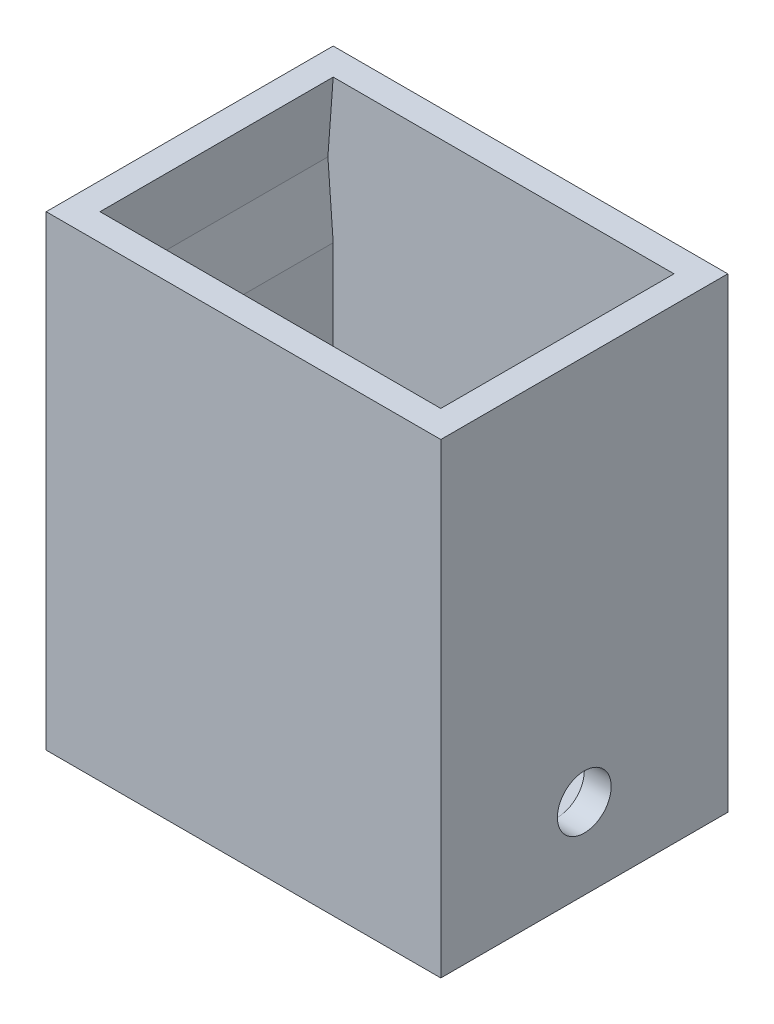
ISO-10303-21;
HEADER;
FILE_DESCRIPTION(('STEP AP214'),'2;1');
FILE_NAME('part.step','',(''),(''),'','','');
FILE_SCHEMA(('AUTOMOTIVE_DESIGN { 1 0 10303 214 1 1 1 1 }'));
ENDSEC;
DATA;
#1=APPLICATION_CONTEXT('core data for automotive mechanical design processes');
#2=APPLICATION_PROTOCOL_DEFINITION('international standard','automotive_design',2000,#1);
#3=PRODUCT_CONTEXT('',#1,'mechanical');
#4=PRODUCT('Part','Part','',(#3));
#5=PRODUCT_RELATED_PRODUCT_CATEGORY('part','',(#4));
#6=PRODUCT_DEFINITION_FORMATION('','',#4);
#7=PRODUCT_DEFINITION_CONTEXT('part definition',#1,'design');
#8=PRODUCT_DEFINITION('design','',#6,#7);
#9=PRODUCT_DEFINITION_SHAPE('','',#8);
#10=(LENGTH_UNIT() NAMED_UNIT(*) SI_UNIT(.MILLI.,.METRE.));
#11=(NAMED_UNIT(*) PLANE_ANGLE_UNIT() SI_UNIT($,.RADIAN.));
#12=(NAMED_UNIT(*) SI_UNIT($,.STERADIAN.) SOLID_ANGLE_UNIT());
#13=UNCERTAINTY_MEASURE_WITH_UNIT(LENGTH_MEASURE(1.E-05),#10,'distance_accuracy_value','');
#14=(GEOMETRIC_REPRESENTATION_CONTEXT(3) GLOBAL_UNCERTAINTY_ASSIGNED_CONTEXT((#13)) GLOBAL_UNIT_ASSIGNED_CONTEXT((#10,
#11,#12)) REPRESENTATION_CONTEXT('',''));
#15=CARTESIAN_POINT('',(0.,0.,0.));
#16=DIRECTION('',(0.,0.,1.));
#17=DIRECTION('',(1.,0.,0.));
#18=AXIS2_PLACEMENT_3D('',#15,#16,#17);
#19=CARTESIAN_POINT('',(-9.74934383202099,23.,-8.5734908136483));
#20=DIRECTION('',(1.,0.,0.));
#21=DIRECTION('',(0.,0.,-1.));
#22=AXIS2_PLACEMENT_3D('',#19,#20,#21);
#23=PLANE('',#22);
#24=DIRECTION('',(0.,-1.,0.));
#25=VECTOR('',#24,1.);
#26=CARTESIAN_POINT('',(-9.74934383202099,23.,-8.5734908136483));
#27=LINE('',#26,#25);
#28=CARTESIAN_POINT('',(-9.74934383202099,15.,-8.5734908136483));
#29=VERTEX_POINT('',#28);
#30=CARTESIAN_POINT('',(-9.74934383202099,0.,-8.5734908136483));
#31=VERTEX_POINT('',#30);
#32=EDGE_CURVE('E170',#29,#31,#27,.T.);
#33=ORIENTED_EDGE('',*,*,#32,.F.);
#34=DIRECTION('',(0.,0.,-1.));
#35=VECTOR('',#34,1.);
#36=CARTESIAN_POINT('',(-9.74934383202099,15.,4.42650918635171));
#37=LINE('',#36,#35);
#38=CARTESIAN_POINT('',(-9.74934383202099,15.,4.42650918635171));
#39=VERTEX_POINT('',#38);
#40=EDGE_CURVE('E59',#39,#29,#37,.T.);
#41=ORIENTED_EDGE('',*,*,#40,.F.);
#42=DIRECTION('',(0.,-1.,0.));
#43=VECTOR('',#42,1.);
#44=CARTESIAN_POINT('',(-9.74934383202099,23.,4.4265091863517));
#45=LINE('',#44,#43);
#46=CARTESIAN_POINT('',(-9.74934383202099,0.,4.4265091863517));
#47=VERTEX_POINT('',#46);
#48=EDGE_CURVE('E165',#39,#47,#45,.T.);
#49=ORIENTED_EDGE('',*,*,#48,.T.);
#50=DIRECTION('',(0.,0.,1.));
#51=VECTOR('',#50,1.);
#52=CARTESIAN_POINT('',(-9.74934383202099,0.,-8.5734908136483));
#53=LINE('',#52,#51);
#54=CARTESIAN_POINT('',(-9.74934383202099,0.,-2.07349081364829));
#55=VERTEX_POINT('',#54);
#56=EDGE_CURVE('E270',#55,#47,#53,.T.);
#57=ORIENTED_EDGE('',*,*,#56,.F.);
#58=CARTESIAN_POINT('',(-9.74934383202099,1.5,-2.07349081364829));
#59=DIRECTION('',(1.,0.,0.));
#60=DIRECTION('',(0.,0.,-1.));
#61=AXIS2_PLACEMENT_3D('',#58,#59,#60);
#62=CIRCLE('',#61,1.5);
#63=EDGE_CURVE('E297',#55,#55,#62,.T.);
#64=ORIENTED_EDGE('',*,*,#63,.F.);
#65=EDGE_CURVE('E282',#31,#55,#53,.T.);
#66=ORIENTED_EDGE('',*,*,#65,.F.);
#67=EDGE_LOOP('',(#33,#41,#49,#57,#64,#66));
#68=FACE_BOUND('',#67,.T.);
#69=ADVANCED_FACE('F43',(#68),#23,.T.);
#70=CARTESIAN_POINT('',(9.25065616797901,23.,-8.5734908136483));
#71=DIRECTION('',(-1.,0.,0.));
#72=DIRECTION('',(0.,0.,1.));
#73=AXIS2_PLACEMENT_3D('',#70,#71,#72);
#74=PLANE('',#73);
#75=DIRECTION('',(0.,-1.,0.));
#76=VECTOR('',#75,1.);
#77=CARTESIAN_POINT('',(9.25065616797901,23.,4.4265091863517));
#78=LINE('',#77,#76);
#79=CARTESIAN_POINT('',(9.25065616797901,15.,4.42650918635171));
#80=VERTEX_POINT('',#79);
#81=CARTESIAN_POINT('',(9.25065616797901,0.,4.4265091863517));
#82=VERTEX_POINT('',#81);
#83=EDGE_CURVE('E143',#80,#82,#78,.T.);
#84=ORIENTED_EDGE('',*,*,#83,.F.);
#85=DIRECTION('',(0.,0.,-1.));
#86=VECTOR('',#85,1.);
#87=CARTESIAN_POINT('',(9.25065616797901,15.,4.42650918635171));
#88=LINE('',#87,#86);
#89=CARTESIAN_POINT('',(9.25065616797901,15.,-8.5734908136483));
#90=VERTEX_POINT('',#89);
#91=EDGE_CURVE('E153',#80,#90,#88,.T.);
#92=ORIENTED_EDGE('',*,*,#91,.T.);
#93=DIRECTION('',(0.,-1.,0.));
#94=VECTOR('',#93,1.);
#95=CARTESIAN_POINT('',(9.25065616797901,23.,-8.5734908136483));
#96=LINE('',#95,#94);
#97=CARTESIAN_POINT('',(9.25065616797901,0.,-8.5734908136483));
#98=VERTEX_POINT('',#97);
#99=EDGE_CURVE('E166',#90,#98,#96,.T.);
#100=ORIENTED_EDGE('',*,*,#99,.T.);
#101=DIRECTION('',(0.,0.,-1.));
#102=VECTOR('',#101,1.);
#103=CARTESIAN_POINT('',(9.25065616797901,0.,-8.5734908136483));
#104=LINE('',#103,#102);
#105=CARTESIAN_POINT('',(9.25065616797901,0.,-2.07349081364829));
#106=VERTEX_POINT('',#105);
#107=EDGE_CURVE('E287',#106,#98,#104,.T.);
#108=ORIENTED_EDGE('',*,*,#107,.F.);
#109=CARTESIAN_POINT('',(9.25065616797901,1.5,-2.0734908136483));
#110=DIRECTION('',(-1.,0.,0.));
#111=DIRECTION('',(0.,0.,1.));
#112=AXIS2_PLACEMENT_3D('',#109,#110,#111);
#113=CIRCLE('',#112,1.5);
#114=EDGE_CURVE('E65',#106,#106,#113,.T.);
#115=ORIENTED_EDGE('',*,*,#114,.F.);
#116=EDGE_CURVE('E163',#82,#106,#104,.T.);
#117=ORIENTED_EDGE('',*,*,#116,.F.);
#118=EDGE_LOOP('',(#84,#92,#100,#108,#115,#117));
#119=FACE_BOUND('',#118,.T.);
#120=ADVANCED_FACE('F161',(#119),#74,.T.);
#121=CARTESIAN_POINT('',(0.,23.,0.));
#122=DIRECTION('',(0.,1.,0.));
#123=DIRECTION('',(0.,0.,1.));
#124=AXIS2_PLACEMENT_3D('',#121,#122,#123);
#125=PLANE('',#124);
#126=DIRECTION('',(0.,0.,1.));
#127=VECTOR('',#126,1.);
#128=CARTESIAN_POINT('',(-11.249343832021,23.,-10.0734908136483));
#129=LINE('',#128,#127);
#130=CARTESIAN_POINT('',(-11.249343832021,23.,-10.0734908136483));
#131=VERTEX_POINT('',#130);
#132=CARTESIAN_POINT('',(-11.249343832021,23.,5.9265091863517));
#133=VERTEX_POINT('',#132);
#134=EDGE_CURVE('E168',#131,#133,#129,.T.);
#135=ORIENTED_EDGE('',*,*,#134,.T.);
#136=DIRECTION('',(1.,0.,0.));
#137=VECTOR('',#136,1.);
#138=CARTESIAN_POINT('',(-11.249343832021,23.,5.9265091863517));
#139=LINE('',#138,#137);
#140=CARTESIAN_POINT('',(10.750656167979,23.,5.9265091863517));
#141=VERTEX_POINT('',#140);
#142=EDGE_CURVE('E176',#133,#141,#139,.T.);
#143=ORIENTED_EDGE('',*,*,#142,.T.);
#144=DIRECTION('',(0.,0.,-1.));
#145=VECTOR('',#144,1.);
#146=CARTESIAN_POINT('',(10.750656167979,23.,-10.0734908136483));
#147=LINE('',#146,#145);
#148=CARTESIAN_POINT('',(10.750656167979,23.,-10.0734908136483));
#149=VERTEX_POINT('',#148);
#150=EDGE_CURVE('E178',#141,#149,#147,.T.);
#151=ORIENTED_EDGE('',*,*,#150,.T.);
#152=DIRECTION('',(-1.,0.,0.));
#153=VECTOR('',#152,1.);
#154=CARTESIAN_POINT('',(-11.249343832021,23.,-10.0734908136483));
#155=LINE('',#154,#153);
#156=EDGE_CURVE('E180',#149,#131,#155,.T.);
#157=ORIENTED_EDGE('',*,*,#156,.T.);
#158=EDGE_LOOP('',(#135,#143,#151,#157));
#159=FACE_BOUND('',#158,.T.);
#160=DIRECTION('',(1.,0.,0.));
#161=VECTOR('',#160,1.);
#162=CARTESIAN_POINT('',(-9.74934383202099,23.,4.4265091863517));
#163=LINE('',#162,#161);
#164=CARTESIAN_POINT('',(-9.74934383202099,23.,4.42650918635171));
#165=VERTEX_POINT('',#164);
#166=CARTESIAN_POINT('',(9.25065616797901,23.,4.42650918635171));
#167=VERTEX_POINT('',#166);
#168=EDGE_CURVE('E274',#165,#167,#163,.T.);
#169=ORIENTED_EDGE('',*,*,#168,.F.);
#170=DIRECTION('',(0.,0.,1.));
#171=VECTOR('',#170,1.);
#172=CARTESIAN_POINT('',(-9.74934383202099,23.,-8.5734908136483));
#173=LINE('',#172,#171);
#174=CARTESIAN_POINT('',(-9.74934383202099,23.,-8.5734908136483));
#175=VERTEX_POINT('',#174);
#176=EDGE_CURVE('E271',#175,#165,#173,.T.);
#177=ORIENTED_EDGE('',*,*,#176,.F.);
#178=DIRECTION('',(-1.,0.,0.));
#179=VECTOR('',#178,1.);
#180=CARTESIAN_POINT('',(-9.74934383202099,23.,-8.5734908136483));
#181=LINE('',#180,#179);
#182=CARTESIAN_POINT('',(9.25065616797901,23.,-8.5734908136483));
#183=VERTEX_POINT('',#182);
#184=EDGE_CURVE('E279',#183,#175,#181,.T.);
#185=ORIENTED_EDGE('',*,*,#184,.F.);
#186=DIRECTION('',(0.,0.,-1.));
#187=VECTOR('',#186,1.);
#188=CARTESIAN_POINT('',(9.25065616797901,23.,-8.5734908136483));
#189=LINE('',#188,#187);
#190=EDGE_CURVE('E277',#167,#183,#189,.T.);
#191=ORIENTED_EDGE('',*,*,#190,.F.);
#192=EDGE_LOOP('',(#169,#177,#185,#191));
#193=FACE_BOUND('',#192,.T.);
#194=ADVANCED_FACE('F215',(#159,#193),#125,.T.);
#195=CARTESIAN_POINT('',(-11.249343832021,23.,-10.0734908136483));
#196=DIRECTION('',(1.,0.,0.));
#197=DIRECTION('',(0.,0.,-1.));
#198=AXIS2_PLACEMENT_3D('',#195,#196,#197);
#199=PLANE('',#198);
#200=CARTESIAN_POINT('',(-11.249343832021,1.5,-2.07349081364829));
#201=DIRECTION('',(1.,0.,0.));
#202=DIRECTION('',(0.,0.,-1.));
#203=AXIS2_PLACEMENT_3D('',#200,#201,#202);
#204=CIRCLE('',#203,1.5);
#205=CARTESIAN_POINT('',(-11.249343832021,1.5,-3.57349081364829));
#206=VERTEX_POINT('',#205);
#207=EDGE_CURVE('E242',#206,#206,#204,.T.);
#208=ORIENTED_EDGE('',*,*,#207,.T.);
#209=EDGE_LOOP('',(#208));
#210=FACE_BOUND('',#209,.T.);
#211=DIRECTION('',(0.,-1.,0.));
#212=VECTOR('',#211,1.);
#213=CARTESIAN_POINT('',(-11.249343832021,23.,-10.0734908136483));
#214=LINE('',#213,#212);
#215=CARTESIAN_POINT('',(-11.249343832021,-3.,-10.0734908136483));
#216=VERTEX_POINT('',#215);
#217=EDGE_CURVE('E182',#131,#216,#214,.T.);
#218=ORIENTED_EDGE('',*,*,#217,.T.);
#219=DIRECTION('',(0.,0.,-1.));
#220=VECTOR('',#219,1.);
#221=CARTESIAN_POINT('',(-11.249343832021,-3.,5.9265091863517));
#222=LINE('',#221,#220);
#223=CARTESIAN_POINT('',(-11.249343832021,-3.,5.9265091863517));
#224=VERTEX_POINT('',#223);
#225=EDGE_CURVE('E249',#224,#216,#222,.T.);
#226=ORIENTED_EDGE('',*,*,#225,.F.);
#227=DIRECTION('',(0.,-1.,0.));
#228=VECTOR('',#227,1.);
#229=CARTESIAN_POINT('',(-11.249343832021,23.,5.9265091863517));
#230=LINE('',#229,#228);
#231=EDGE_CURVE('E188',#133,#224,#230,.T.);
#232=ORIENTED_EDGE('',*,*,#231,.F.);
#233=ORIENTED_EDGE('',*,*,#134,.F.);
#234=EDGE_LOOP('',(#218,#226,#232,#233));
#235=FACE_BOUND('',#234,.T.);
#236=ADVANCED_FACE('F222',(#210,#235),#199,.F.);
#237=CARTESIAN_POINT('',(-11.249343832021,23.,5.9265091863517));
#238=DIRECTION('',(0.,0.,-1.));
#239=DIRECTION('',(-1.,0.,0.));
#240=AXIS2_PLACEMENT_3D('',#237,#238,#239);
#241=PLANE('',#240);
#242=ORIENTED_EDGE('',*,*,#231,.T.);
#243=DIRECTION('',(-1.,0.,0.));
#244=VECTOR('',#243,1.);
#245=CARTESIAN_POINT('',(-11.249343832021,-3.,5.9265091863517));
#246=LINE('',#245,#244);
#247=CARTESIAN_POINT('',(10.750656167979,-3.,5.9265091863517));
#248=VERTEX_POINT('',#247);
#249=EDGE_CURVE('E261',#248,#224,#246,.T.);
#250=ORIENTED_EDGE('',*,*,#249,.F.);
#251=DIRECTION('',(0.,-1.,0.));
#252=VECTOR('',#251,1.);
#253=CARTESIAN_POINT('',(10.750656167979,23.,5.9265091863517));
#254=LINE('',#253,#252);
#255=EDGE_CURVE('E186',#141,#248,#254,.T.);
#256=ORIENTED_EDGE('',*,*,#255,.F.);
#257=ORIENTED_EDGE('',*,*,#142,.F.);
#258=EDGE_LOOP('',(#242,#250,#256,#257));
#259=FACE_BOUND('',#258,.T.);
#260=ADVANCED_FACE('F231',(#259),#241,.F.);
#261=CARTESIAN_POINT('',(10.750656167979,23.,-10.0734908136483));
#262=DIRECTION('',(-1.,0.,0.));
#263=DIRECTION('',(0.,0.,1.));
#264=AXIS2_PLACEMENT_3D('',#261,#262,#263);
#265=PLANE('',#264);
#266=CARTESIAN_POINT('',(10.750656167979,1.5,-2.0734908136483));
#267=DIRECTION('',(1.,0.,0.));
#268=DIRECTION('',(0.,0.,-1.));
#269=AXIS2_PLACEMENT_3D('',#266,#267,#268);
#270=CIRCLE('',#269,1.5);
#271=CARTESIAN_POINT('',(10.750656167979,1.5,-3.5734908136483));
#272=VERTEX_POINT('',#271);
#273=EDGE_CURVE('E158',#272,#272,#270,.T.);
#274=ORIENTED_EDGE('',*,*,#273,.F.);
#275=EDGE_LOOP('',(#274));
#276=FACE_BOUND('',#275,.T.);
#277=ORIENTED_EDGE('',*,*,#255,.T.);
#278=DIRECTION('',(0.,0.,1.));
#279=VECTOR('',#278,1.);
#280=CARTESIAN_POINT('',(10.750656167979,-3.,5.9265091863517));
#281=LINE('',#280,#279);
#282=CARTESIAN_POINT('',(10.750656167979,-3.,-10.0734908136483));
#283=VERTEX_POINT('',#282);
#284=EDGE_CURVE('E257',#283,#248,#281,.T.);
#285=ORIENTED_EDGE('',*,*,#284,.F.);
#286=DIRECTION('',(0.,-1.,0.));
#287=VECTOR('',#286,1.);
#288=CARTESIAN_POINT('',(10.750656167979,23.,-10.0734908136483));
#289=LINE('',#288,#287);
#290=EDGE_CURVE('E184',#149,#283,#289,.T.);
#291=ORIENTED_EDGE('',*,*,#290,.F.);
#292=ORIENTED_EDGE('',*,*,#150,.F.);
#293=EDGE_LOOP('',(#277,#285,#291,#292));
#294=FACE_BOUND('',#293,.T.);
#295=ADVANCED_FACE('F227',(#276,#294),#265,.F.);
#296=CARTESIAN_POINT('',(-11.249343832021,23.,-10.0734908136483));
#297=DIRECTION('',(0.,0.,1.));
#298=DIRECTION('',(1.,0.,0.));
#299=AXIS2_PLACEMENT_3D('',#296,#297,#298);
#300=PLANE('',#299);
#301=ORIENTED_EDGE('',*,*,#290,.T.);
#302=DIRECTION('',(1.,0.,0.));
#303=VECTOR('',#302,1.);
#304=CARTESIAN_POINT('',(-11.249343832021,-3.,-10.0734908136483));
#305=LINE('',#304,#303);
#306=EDGE_CURVE('E252',#216,#283,#305,.T.);
#307=ORIENTED_EDGE('',*,*,#306,.F.);
#308=ORIENTED_EDGE('',*,*,#217,.F.);
#309=ORIENTED_EDGE('',*,*,#156,.F.);
#310=EDGE_LOOP('',(#301,#307,#308,#309));
#311=FACE_BOUND('',#310,.T.);
#312=ADVANCED_FACE('F224',(#311),#300,.F.);
#313=CARTESIAN_POINT('',(-9.74934383202099,23.,4.4265091863517));
#314=DIRECTION('',(0.,0.,-1.));
#315=DIRECTION('',(-1.,0.,0.));
#316=AXIS2_PLACEMENT_3D('',#313,#314,#315);
#317=PLANE('',#316);
#318=DIRECTION('',(1.,0.,0.));
#319=VECTOR('',#318,1.);
#320=CARTESIAN_POINT('',(-9.74934383202099,0.,4.4265091863517));
#321=LINE('',#320,#319);
#322=EDGE_CURVE('E285',#47,#82,#321,.T.);
#323=ORIENTED_EDGE('',*,*,#322,.F.);
#324=ORIENTED_EDGE('',*,*,#48,.F.);
#325=DIRECTION('',(0.0734122127331887,-0.997301683053637,0.));
#326=VECTOR('',#325,1.);
#327=CARTESIAN_POINT('',(-10.0437871844413,19.,4.42650918635171));
#328=LINE('',#327,#326);
#329=CARTESIAN_POINT('',(-10.0437871844413,19.,4.42650918635171));
#330=VERTEX_POINT('',#329);
#331=EDGE_CURVE('E319',#330,#39,#328,.T.);
#332=ORIENTED_EDGE('',*,*,#331,.F.);
#333=DIRECTION('',(-0.0734122127331878,-0.997301683053637,0.));
#334=VECTOR('',#333,1.);
#335=CARTESIAN_POINT('',(-9.74934383202099,23.,4.42650918635171));
#336=LINE('',#335,#334);
#337=EDGE_CURVE('E321',#165,#330,#336,.T.);
#338=ORIENTED_EDGE('',*,*,#337,.F.);
#339=ORIENTED_EDGE('',*,*,#168,.T.);
#340=DIRECTION('',(-0.0734122127331887,0.997301683053637,0.));
#341=VECTOR('',#340,1.);
#342=CARTESIAN_POINT('',(9.25065616797901,23.,4.42650918635171));
#343=LINE('',#342,#341);
#344=CARTESIAN_POINT('',(9.54509952039934,19.,4.42650918635171));
#345=VERTEX_POINT('',#344);
#346=EDGE_CURVE('E146',#345,#167,#343,.T.);
#347=ORIENTED_EDGE('',*,*,#346,.F.);
#348=DIRECTION('',(0.0734122127331887,0.997301683053637,0.));
#349=VECTOR('',#348,1.);
#350=CARTESIAN_POINT('',(9.54509952039934,19.,4.42650918635171));
#351=LINE('',#350,#349);
#352=EDGE_CURVE('E138',#80,#345,#351,.T.);
#353=ORIENTED_EDGE('',*,*,#352,.F.);
#354=ORIENTED_EDGE('',*,*,#83,.T.);
#355=EDGE_LOOP('',(#323,#324,#332,#338,#339,#347,#353,#354));
#356=FACE_BOUND('',#355,.T.);
#357=ADVANCED_FACE('F141',(#356),#317,.T.);
#358=CARTESIAN_POINT('',(-9.74934383202099,23.,-8.5734908136483));
#359=DIRECTION('',(0.,0.,1.));
#360=DIRECTION('',(1.,0.,0.));
#361=AXIS2_PLACEMENT_3D('',#358,#359,#360);
#362=PLANE('',#361);
#363=DIRECTION('',(-1.,0.,0.));
#364=VECTOR('',#363,1.);
#365=CARTESIAN_POINT('',(-9.74934383202099,0.,-8.5734908136483));
#366=LINE('',#365,#364);
#367=EDGE_CURVE('E275',#98,#31,#366,.T.);
#368=ORIENTED_EDGE('',*,*,#367,.F.);
#369=ORIENTED_EDGE('',*,*,#99,.F.);
#370=DIRECTION('',(0.0734122127331887,0.997301683053637,0.));
#371=VECTOR('',#370,1.);
#372=CARTESIAN_POINT('',(9.54509952039934,19.,-8.5734908136483));
#373=LINE('',#372,#371);
#374=CARTESIAN_POINT('',(9.54509952039934,19.,-8.5734908136483));
#375=VERTEX_POINT('',#374);
#376=EDGE_CURVE('E155',#90,#375,#373,.T.);
#377=ORIENTED_EDGE('',*,*,#376,.T.);
#378=DIRECTION('',(-0.0734122127331887,0.997301683053637,0.));
#379=VECTOR('',#378,1.);
#380=CARTESIAN_POINT('',(9.25065616797901,23.,-8.5734908136483));
#381=LINE('',#380,#379);
#382=EDGE_CURVE('E150',#375,#183,#381,.T.);
#383=ORIENTED_EDGE('',*,*,#382,.T.);
#384=ORIENTED_EDGE('',*,*,#184,.T.);
#385=DIRECTION('',(-0.0734122127331878,-0.997301683053637,0.));
#386=VECTOR('',#385,1.);
#387=CARTESIAN_POINT('',(-9.74934383202099,23.,-8.5734908136483));
#388=LINE('',#387,#386);
#389=CARTESIAN_POINT('',(-10.0437871844413,19.,-8.5734908136483));
#390=VERTEX_POINT('',#389);
#391=EDGE_CURVE('E306',#175,#390,#388,.T.);
#392=ORIENTED_EDGE('',*,*,#391,.T.);
#393=DIRECTION('',(0.0734122127331887,-0.997301683053637,0.));
#394=VECTOR('',#393,1.);
#395=CARTESIAN_POINT('',(-10.0437871844413,19.,-8.5734908136483));
#396=LINE('',#395,#394);
#397=EDGE_CURVE('E294',#390,#29,#396,.T.);
#398=ORIENTED_EDGE('',*,*,#397,.T.);
#399=ORIENTED_EDGE('',*,*,#32,.T.);
#400=EDGE_LOOP('',(#368,#369,#377,#383,#384,#392,#398,#399));
#401=FACE_BOUND('',#400,.T.);
#402=ADVANCED_FACE('F293',(#401),#362,.T.);
#403=CARTESIAN_POINT('',(0.,0.,0.));
#404=DIRECTION('',(0.,-1.,0.));
#405=DIRECTION('',(0.,0.,-1.));
#406=AXIS2_PLACEMENT_3D('',#403,#404,#405);
#407=PLANE('',#406);
#408=CARTESIAN_POINT('',(-0.249343832020993,0.,-2.0734908136483));
#409=DIRECTION('',(0.,-1.,0.));
#410=DIRECTION('',(0.,0.,-1.));
#411=AXIS2_PLACEMENT_3D('',#408,#409,#410);
#412=CIRCLE('',#411,3.25000000000001);
#413=CARTESIAN_POINT('',(-0.249343832020993,0.,-5.3234908136483));
#414=VERTEX_POINT('',#413);
#415=EDGE_CURVE('E11',#414,#414,#412,.T.);
#416=ORIENTED_EDGE('',*,*,#415,.T.);
#417=EDGE_LOOP('',(#416));
#418=FACE_BOUND('',#417,.T.);
#419=ORIENTED_EDGE('',*,*,#65,.T.);
#420=ORIENTED_EDGE('',*,*,#56,.T.);
#421=ORIENTED_EDGE('',*,*,#322,.T.);
#422=ORIENTED_EDGE('',*,*,#116,.T.);
#423=ORIENTED_EDGE('',*,*,#107,.T.);
#424=ORIENTED_EDGE('',*,*,#367,.T.);
#425=EDGE_LOOP('',(#419,#420,#421,#422,#423,#424));
#426=FACE_BOUND('',#425,.T.);
#427=ADVANCED_FACE('F301',(#418,#426),#407,.F.);
#428=CARTESIAN_POINT('',(0.,-3.,0.));
#429=DIRECTION('',(0.,-1.,0.));
#430=DIRECTION('',(0.,0.,-1.));
#431=AXIS2_PLACEMENT_3D('',#428,#429,#430);
#432=PLANE('',#431);
#433=CARTESIAN_POINT('',(-0.249343832020993,-3.,-2.0734908136483));
#434=DIRECTION('',(0.,1.,0.));
#435=DIRECTION('',(0.,0.,1.));
#436=AXIS2_PLACEMENT_3D('',#433,#434,#435);
#437=CIRCLE('',#436,1.25);
#438=CARTESIAN_POINT('',(-0.249343832020993,-3.,-0.823490813648295));
#439=VERTEX_POINT('',#438);
#440=EDGE_CURVE('E262',#439,#439,#437,.T.);
#441=ORIENTED_EDGE('',*,*,#440,.T.);
#442=EDGE_LOOP('',(#441));
#443=FACE_BOUND('',#442,.T.);
#444=ORIENTED_EDGE('',*,*,#225,.T.);
#445=ORIENTED_EDGE('',*,*,#306,.T.);
#446=ORIENTED_EDGE('',*,*,#284,.T.);
#447=ORIENTED_EDGE('',*,*,#249,.T.);
#448=EDGE_LOOP('',(#444,#445,#446,#447));
#449=FACE_BOUND('',#448,.T.);
#450=ADVANCED_FACE('F205',(#443,#449),#432,.T.);
#451=CARTESIAN_POINT('',(-0.249343832020993,-3.,-2.0734908136483));
#452=DIRECTION('',(0.,1.,0.));
#453=DIRECTION('',(0.,0.,1.));
#454=AXIS2_PLACEMENT_3D('',#451,#452,#453);
#455=CYLINDRICAL_SURFACE('',#454,1.25);
#456=CARTESIAN_POINT('',(-0.249343832020993,-2.,-2.0734908136483));
#457=DIRECTION('',(0.,-1.,0.));
#458=DIRECTION('',(0.,0.,-1.));
#459=AXIS2_PLACEMENT_3D('',#456,#457,#458);
#460=CIRCLE('',#459,1.25);
#461=CARTESIAN_POINT('',(-0.249343832020993,-2.,-3.3234908136483));
#462=VERTEX_POINT('',#461);
#463=EDGE_CURVE('E52',#462,#462,#460,.F.);
#464=ORIENTED_EDGE('',*,*,#463,.T.);
#465=EDGE_LOOP('',(#464));
#466=FACE_BOUND('',#465,.T.);
#467=ORIENTED_EDGE('',*,*,#440,.F.);
#468=EDGE_LOOP('',(#467));
#469=FACE_BOUND('',#468,.T.);
#470=ADVANCED_FACE('F192',(#466,#469),#455,.F.);
#471=CARTESIAN_POINT('',(-0.249343832020993,-2.,-2.0734908136483));
#472=DIRECTION('',(0.,1.,0.));
#473=DIRECTION('',(0.,0.,1.));
#474=AXIS2_PLACEMENT_3D('',#471,#472,#473);
#475=CONICAL_SURFACE('',#474,1.25,0.785398163397451);
#476=ORIENTED_EDGE('',*,*,#415,.F.);
#477=EDGE_LOOP('',(#476));
#478=FACE_BOUND('',#477,.T.);
#479=ORIENTED_EDGE('',*,*,#463,.F.);
#480=EDGE_LOOP('',(#479));
#481=FACE_BOUND('',#480,.T.);
#482=ADVANCED_FACE('F46',(#478,#481),#475,.F.);
#483=CARTESIAN_POINT('',(-17.249343832021,1.5,-2.07349081364829));
#484=DIRECTION('',(1.,0.,0.));
#485=DIRECTION('',(0.,0.,-1.));
#486=AXIS2_PLACEMENT_3D('',#483,#484,#485);
#487=CYLINDRICAL_SURFACE('',#486,1.5);
#488=ORIENTED_EDGE('',*,*,#114,.T.);
#489=EDGE_LOOP('',(#488));
#490=FACE_BOUND('',#489,.T.);
#491=ORIENTED_EDGE('',*,*,#273,.T.);
#492=EDGE_LOOP('',(#491));
#493=FACE_BOUND('',#492,.T.);
#494=ADVANCED_FACE('F196',(#490,#493),#487,.F.);
#495=ORIENTED_EDGE('',*,*,#63,.T.);
#496=EDGE_LOOP('',(#495));
#497=FACE_BOUND('',#496,.T.);
#498=ORIENTED_EDGE('',*,*,#207,.F.);
#499=EDGE_LOOP('',(#498));
#500=FACE_BOUND('',#499,.T.);
#501=ADVANCED_FACE('F202',(#497,#500),#487,.F.);
#502=CARTESIAN_POINT('',(-9.74934383202099,23.,4.42650918635171));
#503=DIRECTION('',(0.997301683053637,-0.0734122127331877,0.));
#504=DIRECTION('',(0.0734122127331877,0.997301683053637,0.));
#505=AXIS2_PLACEMENT_3D('',#502,#503,#504);
#506=PLANE('',#505);
#507=ORIENTED_EDGE('',*,*,#391,.F.);
#508=ORIENTED_EDGE('',*,*,#176,.T.);
#509=ORIENTED_EDGE('',*,*,#337,.T.);
#510=DIRECTION('',(0.,0.,-1.));
#511=VECTOR('',#510,1.);
#512=CARTESIAN_POINT('',(-10.0437871844413,19.,4.42650918635171));
#513=LINE('',#512,#511);
#514=EDGE_CURVE('E315',#330,#390,#513,.T.);
#515=ORIENTED_EDGE('',*,*,#514,.T.);
#516=EDGE_LOOP('',(#507,#508,#509,#515));
#517=FACE_BOUND('',#516,.T.);
#518=ADVANCED_FACE('F330',(#517),#506,.T.);
#519=CARTESIAN_POINT('',(-10.0437871844413,19.,4.42650918635171));
#520=DIRECTION('',(0.997301683053637,0.0734122127331887,0.));
#521=DIRECTION('',(-0.0734122127331887,0.997301683053637,0.));
#522=AXIS2_PLACEMENT_3D('',#519,#520,#521);
#523=PLANE('',#522);
#524=ORIENTED_EDGE('',*,*,#397,.F.);
#525=ORIENTED_EDGE('',*,*,#514,.F.);
#526=ORIENTED_EDGE('',*,*,#331,.T.);
#527=ORIENTED_EDGE('',*,*,#40,.T.);
#528=EDGE_LOOP('',(#524,#525,#526,#527));
#529=FACE_BOUND('',#528,.T.);
#530=ADVANCED_FACE('F334',(#529),#523,.T.);
#531=CARTESIAN_POINT('',(9.54509952039934,19.,4.42650918635171));
#532=DIRECTION('',(-0.997301683053637,0.0734122127331887,0.));
#533=DIRECTION('',(-0.0734122127331887,-0.997301683053637,0.));
#534=AXIS2_PLACEMENT_3D('',#531,#532,#533);
#535=PLANE('',#534);
#536=ORIENTED_EDGE('',*,*,#376,.F.);
#537=ORIENTED_EDGE('',*,*,#91,.F.);
#538=ORIENTED_EDGE('',*,*,#352,.T.);
#539=DIRECTION('',(0.,0.,-1.));
#540=VECTOR('',#539,1.);
#541=CARTESIAN_POINT('',(9.54509952039934,19.,4.42650918635171));
#542=LINE('',#541,#540);
#543=EDGE_CURVE('E159',#345,#375,#542,.T.);
#544=ORIENTED_EDGE('',*,*,#543,.T.);
#545=EDGE_LOOP('',(#536,#537,#538,#544));
#546=FACE_BOUND('',#545,.T.);
#547=ADVANCED_FACE('F154',(#546),#535,.T.);
#548=CARTESIAN_POINT('',(9.25065616797901,23.,4.42650918635171));
#549=DIRECTION('',(-0.997301683053637,-0.0734122127331887,0.));
#550=DIRECTION('',(0.0734122127331887,-0.997301683053637,0.));
#551=AXIS2_PLACEMENT_3D('',#548,#549,#550);
#552=PLANE('',#551);
#553=ORIENTED_EDGE('',*,*,#382,.F.);
#554=ORIENTED_EDGE('',*,*,#543,.F.);
#555=ORIENTED_EDGE('',*,*,#346,.T.);
#556=ORIENTED_EDGE('',*,*,#190,.T.);
#557=EDGE_LOOP('',(#553,#554,#555,#556));
#558=FACE_BOUND('',#557,.T.);
#559=ADVANCED_FACE('F310',(#558),#552,.T.);
#560=CLOSED_SHELL('',(#69,#120,#194,#236,#260,#295,#312,#357,#402,#427,#450,#470,#482,#494,#501,
#518,#530,#547,#559));
#561=MANIFOLD_SOLID_BREP('B2',#560);
#562=ADVANCED_BREP_SHAPE_REPRESENTATION('',(#18,#561),#14);
#563=SHAPE_DEFINITION_REPRESENTATION(#9,#562);
ENDSEC;
END-ISO-10303-21;
